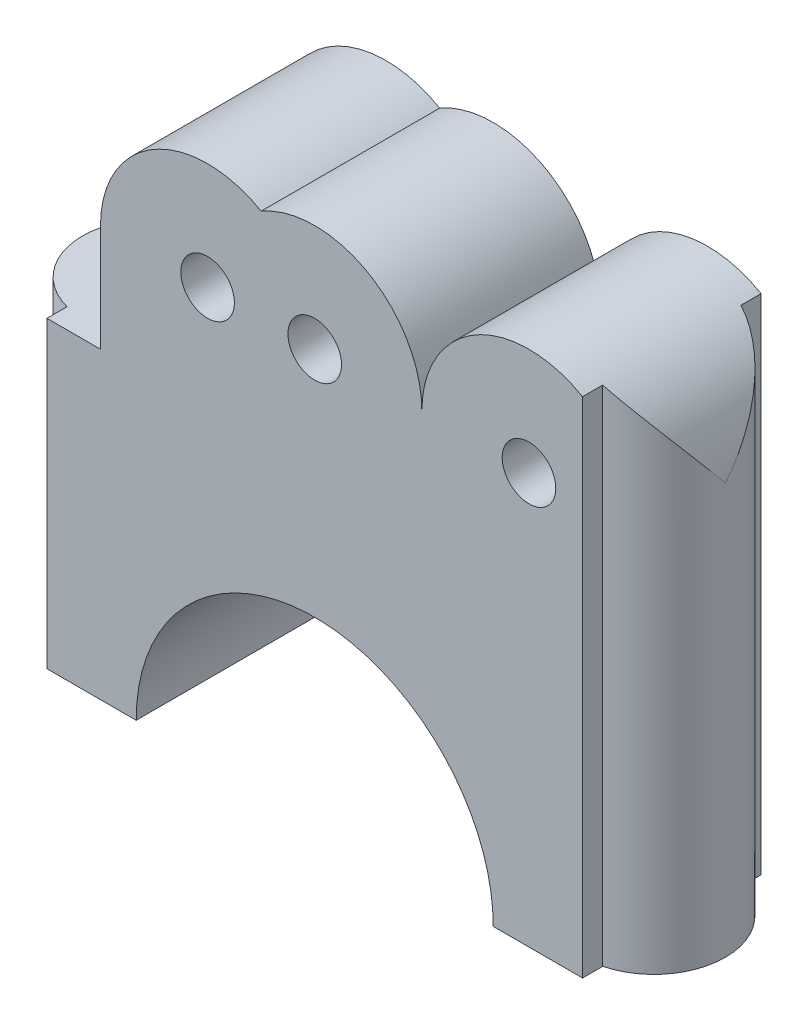
ISO-10303-21;
HEADER;
FILE_DESCRIPTION(('STEP AP214'),'2;1');
FILE_NAME('part.step','',(''),(''),'','','');
FILE_SCHEMA(('AUTOMOTIVE_DESIGN { 1 0 10303 214 1 1 1 1 }'));
ENDSEC;
DATA;
#1=APPLICATION_CONTEXT('core data for automotive mechanical design processes');
#2=APPLICATION_PROTOCOL_DEFINITION('international standard','automotive_design',2000,#1);
#3=PRODUCT_CONTEXT('',#1,'mechanical');
#4=PRODUCT('Part','Part','',(#3));
#5=PRODUCT_RELATED_PRODUCT_CATEGORY('part','',(#4));
#6=PRODUCT_DEFINITION_FORMATION('','',#4);
#7=PRODUCT_DEFINITION_CONTEXT('part definition',#1,'design');
#8=PRODUCT_DEFINITION('design','',#6,#7);
#9=PRODUCT_DEFINITION_SHAPE('','',#8);
#10=(LENGTH_UNIT() NAMED_UNIT(*) SI_UNIT(.MILLI.,.METRE.));
#11=(NAMED_UNIT(*) PLANE_ANGLE_UNIT() SI_UNIT($,.RADIAN.));
#12=(NAMED_UNIT(*) SI_UNIT($,.STERADIAN.) SOLID_ANGLE_UNIT());
#13=UNCERTAINTY_MEASURE_WITH_UNIT(LENGTH_MEASURE(1.E-05),#10,'distance_accuracy_value','');
#14=(GEOMETRIC_REPRESENTATION_CONTEXT(3) GLOBAL_UNCERTAINTY_ASSIGNED_CONTEXT((#13)) GLOBAL_UNIT_ASSIGNED_CONTEXT((#10,
#11,#12)) REPRESENTATION_CONTEXT('',''));
#15=CARTESIAN_POINT('',(0.,0.,0.));
#16=DIRECTION('',(0.,0.,1.));
#17=DIRECTION('',(1.,0.,0.));
#18=AXIS2_PLACEMENT_3D('',#15,#16,#17);
#19=CARTESIAN_POINT('',(0.,0.,0.));
#20=DIRECTION('',(0.,1.,0.));
#21=DIRECTION('',(0.,0.,1.));
#22=AXIS2_PLACEMENT_3D('',#19,#20,#21);
#23=PLANE('',#22);
#24=DIRECTION('',(0.,0.,-1.));
#25=VECTOR('',#24,1.);
#26=CARTESIAN_POINT('',(-10.,0.,10.));
#27=LINE('',#26,#25);
#28=CARTESIAN_POINT('',(-10.,0.,0.));
#29=VERTEX_POINT('',#28);
#30=CARTESIAN_POINT('',(-10.,0.,10.));
#31=VERTEX_POINT('',#30);
#32=EDGE_CURVE('E273',#29,#31,#27,.F.);
#33=ORIENTED_EDGE('',*,*,#32,.T.);
#34=DIRECTION('',(-1.,0.,0.));
#35=VECTOR('',#34,1.);
#36=CARTESIAN_POINT('',(0.,0.,10.));
#37=LINE('',#36,#35);
#38=CARTESIAN_POINT('',(-15.,0.,10.));
#39=VERTEX_POINT('',#38);
#40=EDGE_CURVE('E288',#31,#39,#37,.T.);
#41=ORIENTED_EDGE('',*,*,#40,.T.);
#42=DIRECTION('',(0.,0.,-1.));
#43=VECTOR('',#42,1.);
#44=CARTESIAN_POINT('',(-15.,0.,0.));
#45=LINE('',#44,#43);
#46=CARTESIAN_POINT('',(-15.,0.,8.87298334620742));
#47=VERTEX_POINT('',#46);
#48=EDGE_CURVE('E11',#39,#47,#45,.T.);
#49=ORIENTED_EDGE('',*,*,#48,.T.);
#50=CARTESIAN_POINT('',(-14.,0.,5.));
#51=DIRECTION('',(0.,1.,0.));
#52=DIRECTION('',(0.,0.,1.));
#53=AXIS2_PLACEMENT_3D('',#50,#51,#52);
#54=CIRCLE('',#53,4.);
#55=CARTESIAN_POINT('',(-15.,0.,1.12701665379258));
#56=VERTEX_POINT('',#55);
#57=EDGE_CURVE('E51',#47,#56,#54,.F.);
#58=ORIENTED_EDGE('',*,*,#57,.T.);
#59=DIRECTION('',(0.,0.,-1.));
#60=VECTOR('',#59,1.);
#61=CARTESIAN_POINT('',(-15.,0.,0.));
#62=LINE('',#61,#60);
#63=CARTESIAN_POINT('',(-15.,0.,0.));
#64=VERTEX_POINT('',#63);
#65=EDGE_CURVE('E289',#56,#64,#62,.T.);
#66=ORIENTED_EDGE('',*,*,#65,.T.);
#67=DIRECTION('',(-1.,0.,0.));
#68=VECTOR('',#67,1.);
#69=CARTESIAN_POINT('',(0.,0.,0.));
#70=LINE('',#69,#68);
#71=EDGE_CURVE('E282',#29,#64,#70,.T.);
#72=ORIENTED_EDGE('',*,*,#71,.F.);
#73=EDGE_LOOP('',(#33,#41,#49,#58,#66,#72));
#74=FACE_BOUND('',#73,.T.);
#75=CARTESIAN_POINT('',(-14.,0.,5.));
#76=DIRECTION('',(0.,1.,0.));
#77=DIRECTION('',(0.,0.,1.));
#78=AXIS2_PLACEMENT_3D('',#75,#76,#77);
#79=CIRCLE('',#78,2.);
#80=CARTESIAN_POINT('',(-14.,0.,7.));
#81=VERTEX_POINT('',#80);
#82=EDGE_CURVE('E38',#81,#81,#79,.F.);
#83=ORIENTED_EDGE('',*,*,#82,.F.);
#84=EDGE_LOOP('',(#83));
#85=FACE_BOUND('',#84,.T.);
#86=ADVANCED_FACE('F34',(#74,#85),#23,.F.);
#87=CARTESIAN_POINT('',(-6.00000000000001,23.,10.));
#88=DIRECTION('',(0.,0.,-1.));
#89=DIRECTION('',(-1.,0.,0.));
#90=AXIS2_PLACEMENT_3D('',#87,#88,#89);
#91=CYLINDRICAL_SURFACE('',#90,1.5);
#92=CARTESIAN_POINT('',(-6.00000000000001,23.,10.));
#93=DIRECTION('',(0.,0.,1.));
#94=DIRECTION('',(1.,0.,0.));
#95=AXIS2_PLACEMENT_3D('',#92,#93,#94);
#96=CIRCLE('',#95,1.5);
#97=CARTESIAN_POINT('',(-4.50000000000001,23.,10.));
#98=VERTEX_POINT('',#97);
#99=EDGE_CURVE('E258',#98,#98,#96,.T.);
#100=ORIENTED_EDGE('',*,*,#99,.T.);
#101=EDGE_LOOP('',(#100));
#102=FACE_BOUND('',#101,.T.);
#103=CARTESIAN_POINT('',(-6.00000000000001,23.,0.));
#104=DIRECTION('',(0.,0.,1.));
#105=DIRECTION('',(1.,0.,0.));
#106=AXIS2_PLACEMENT_3D('',#103,#104,#105);
#107=CIRCLE('',#106,1.5);
#108=CARTESIAN_POINT('',(-4.50000000000001,23.,0.));
#109=VERTEX_POINT('',#108);
#110=EDGE_CURVE('E304',#109,#109,#107,.T.);
#111=ORIENTED_EDGE('',*,*,#110,.F.);
#112=EDGE_LOOP('',(#111));
#113=FACE_BOUND('',#112,.T.);
#114=ADVANCED_FACE('F36',(#102,#113),#91,.F.);
#115=CARTESIAN_POINT('',(0.,23.,10.));
#116=DIRECTION('',(0.,0.,-1.));
#117=DIRECTION('',(-1.,0.,0.));
#118=AXIS2_PLACEMENT_3D('',#115,#116,#117);
#119=CYLINDRICAL_SURFACE('',#118,1.5);
#120=CARTESIAN_POINT('',(0.,23.,10.));
#121=DIRECTION('',(0.,0.,1.));
#122=DIRECTION('',(1.,0.,0.));
#123=AXIS2_PLACEMENT_3D('',#120,#121,#122);
#124=CIRCLE('',#123,1.5);
#125=CARTESIAN_POINT('',(1.5,23.,10.));
#126=VERTEX_POINT('',#125);
#127=EDGE_CURVE('E241',#126,#126,#124,.T.);
#128=ORIENTED_EDGE('',*,*,#127,.T.);
#129=EDGE_LOOP('',(#128));
#130=FACE_BOUND('',#129,.T.);
#131=CARTESIAN_POINT('',(0.,23.,0.));
#132=DIRECTION('',(0.,0.,1.));
#133=DIRECTION('',(1.,0.,0.));
#134=AXIS2_PLACEMENT_3D('',#131,#132,#133);
#135=CIRCLE('',#134,1.5);
#136=CARTESIAN_POINT('',(1.5,23.,0.));
#137=VERTEX_POINT('',#136);
#138=EDGE_CURVE('E244',#137,#137,#135,.T.);
#139=ORIENTED_EDGE('',*,*,#138,.F.);
#140=EDGE_LOOP('',(#139));
#141=FACE_BOUND('',#140,.T.);
#142=ADVANCED_FACE('F229',(#130,#141),#119,.F.);
#143=CARTESIAN_POINT('',(12.,23.,10.));
#144=DIRECTION('',(0.,0.,-1.));
#145=DIRECTION('',(-1.,0.,0.));
#146=AXIS2_PLACEMENT_3D('',#143,#144,#145);
#147=CYLINDRICAL_SURFACE('',#146,1.5);
#148=CARTESIAN_POINT('',(12.,23.,10.));
#149=DIRECTION('',(0.,0.,1.));
#150=DIRECTION('',(1.,0.,0.));
#151=AXIS2_PLACEMENT_3D('',#148,#149,#150);
#152=CIRCLE('',#151,1.5);
#153=CARTESIAN_POINT('',(13.5,23.,10.));
#154=VERTEX_POINT('',#153);
#155=EDGE_CURVE('E325',#154,#154,#152,.T.);
#156=ORIENTED_EDGE('',*,*,#155,.T.);
#157=EDGE_LOOP('',(#156));
#158=FACE_BOUND('',#157,.T.);
#159=CARTESIAN_POINT('',(12.,23.,0.));
#160=DIRECTION('',(0.,0.,1.));
#161=DIRECTION('',(1.,0.,0.));
#162=AXIS2_PLACEMENT_3D('',#159,#160,#161);
#163=CIRCLE('',#162,1.5);
#164=CARTESIAN_POINT('',(13.5,23.,0.));
#165=VERTEX_POINT('',#164);
#166=EDGE_CURVE('E246',#165,#165,#163,.T.);
#167=ORIENTED_EDGE('',*,*,#166,.F.);
#168=EDGE_LOOP('',(#167));
#169=FACE_BOUND('',#168,.T.);
#170=ADVANCED_FACE('F226',(#158,#169),#147,.F.);
#171=CARTESIAN_POINT('',(0.,23.,10.));
#172=DIRECTION('',(0.,0.,-1.));
#173=DIRECTION('',(-1.,0.,0.));
#174=AXIS2_PLACEMENT_3D('',#171,#172,#173);
#175=CYLINDRICAL_SURFACE('',#174,6.);
#176=CARTESIAN_POINT('',(0.,23.,0.));
#177=DIRECTION('',(0.,0.,1.));
#178=DIRECTION('',(1.,0.,0.));
#179=AXIS2_PLACEMENT_3D('',#176,#177,#178);
#180=CIRCLE('',#179,6.);
#181=CARTESIAN_POINT('',(6.,23.,0.));
#182=VERTEX_POINT('',#181);
#183=CARTESIAN_POINT('',(-3.00000000000001,28.1961524227066,0.));
#184=VERTEX_POINT('',#183);
#185=EDGE_CURVE('E332',#182,#184,#180,.T.);
#186=ORIENTED_EDGE('',*,*,#185,.T.);
#187=DIRECTION('',(0.,0.,-1.));
#188=VECTOR('',#187,1.);
#189=CARTESIAN_POINT('',(-3.00000000000001,28.1961524227066,10.));
#190=LINE('',#189,#188);
#191=CARTESIAN_POINT('',(-3.00000000000001,28.1961524227066,10.));
#192=VERTEX_POINT('',#191);
#193=EDGE_CURVE('E270',#192,#184,#190,.T.);
#194=ORIENTED_EDGE('',*,*,#193,.F.);
#195=CARTESIAN_POINT('',(0.,23.,10.));
#196=DIRECTION('',(0.,0.,1.));
#197=DIRECTION('',(1.,0.,0.));
#198=AXIS2_PLACEMENT_3D('',#195,#196,#197);
#199=CIRCLE('',#198,6.);
#200=CARTESIAN_POINT('',(6.,23.,10.));
#201=VERTEX_POINT('',#200);
#202=EDGE_CURVE('E312',#201,#192,#199,.T.);
#203=ORIENTED_EDGE('',*,*,#202,.F.);
#204=DIRECTION('',(0.,0.,-1.));
#205=VECTOR('',#204,1.);
#206=CARTESIAN_POINT('',(6.,23.,10.));
#207=LINE('',#206,#205);
#208=EDGE_CURVE('E259',#201,#182,#207,.T.);
#209=ORIENTED_EDGE('',*,*,#208,.T.);
#210=EDGE_LOOP('',(#186,#194,#203,#209));
#211=FACE_BOUND('',#210,.T.);
#212=ADVANCED_FACE('F228',(#211),#175,.T.);
#213=CARTESIAN_POINT('',(-6.00000000000001,23.,10.));
#214=DIRECTION('',(0.,0.,-1.));
#215=DIRECTION('',(-1.,0.,0.));
#216=AXIS2_PLACEMENT_3D('',#213,#214,#215);
#217=CYLINDRICAL_SURFACE('',#216,6.);
#218=CARTESIAN_POINT('',(-6.00000000000001,23.,0.));
#219=DIRECTION('',(0.,0.,1.));
#220=DIRECTION('',(1.,0.,0.));
#221=AXIS2_PLACEMENT_3D('',#218,#219,#220);
#222=CIRCLE('',#221,6.);
#223=CARTESIAN_POINT('',(-12.,23.,0.));
#224=VERTEX_POINT('',#223);
#225=EDGE_CURVE('E335',#184,#224,#222,.T.);
#226=ORIENTED_EDGE('',*,*,#225,.T.);
#227=DIRECTION('',(0.,0.,-1.));
#228=VECTOR('',#227,1.);
#229=CARTESIAN_POINT('',(-12.,23.,10.));
#230=LINE('',#229,#228);
#231=CARTESIAN_POINT('',(-12.,23.,10.));
#232=VERTEX_POINT('',#231);
#233=EDGE_CURVE('E267',#232,#224,#230,.T.);
#234=ORIENTED_EDGE('',*,*,#233,.F.);
#235=CARTESIAN_POINT('',(-6.00000000000001,23.,10.));
#236=DIRECTION('',(0.,0.,1.));
#237=DIRECTION('',(1.,0.,0.));
#238=AXIS2_PLACEMENT_3D('',#235,#236,#237);
#239=CIRCLE('',#238,6.);
#240=EDGE_CURVE('E315',#192,#232,#239,.T.);
#241=ORIENTED_EDGE('',*,*,#240,.F.);
#242=ORIENTED_EDGE('',*,*,#193,.T.);
#243=EDGE_LOOP('',(#226,#234,#241,#242));
#244=FACE_BOUND('',#243,.T.);
#245=ADVANCED_FACE('F355',(#244),#217,.T.);
#246=CARTESIAN_POINT('',(-12.,0.,10.));
#247=DIRECTION('',(1.,0.,0.));
#248=DIRECTION('',(0.,0.,-1.));
#249=AXIS2_PLACEMENT_3D('',#246,#247,#248);
#250=PLANE('',#249);
#251=DIRECTION('',(0.,-1.,0.));
#252=VECTOR('',#251,1.);
#253=CARTESIAN_POINT('',(-12.,0.,0.));
#254=LINE('',#253,#252);
#255=CARTESIAN_POINT('',(-12.,17.,0.));
#256=VERTEX_POINT('',#255);
#257=EDGE_CURVE('E337',#224,#256,#254,.T.);
#258=ORIENTED_EDGE('',*,*,#257,.T.);
#259=DIRECTION('',(0.,0.,-1.));
#260=VECTOR('',#259,1.);
#261=CARTESIAN_POINT('',(-12.,17.,10.));
#262=LINE('',#261,#260);
#263=CARTESIAN_POINT('',(-12.,17.,5.));
#264=VERTEX_POINT('',#263);
#265=EDGE_CURVE('E262',#264,#256,#262,.T.);
#266=ORIENTED_EDGE('',*,*,#265,.F.);
#267=CARTESIAN_POINT('',(-12.,17.,10.));
#268=VERTEX_POINT('',#267);
#269=EDGE_CURVE('E264',#268,#264,#262,.T.);
#270=ORIENTED_EDGE('',*,*,#269,.F.);
#271=DIRECTION('',(0.,-1.,0.));
#272=VECTOR('',#271,1.);
#273=CARTESIAN_POINT('',(-12.,0.,10.));
#274=LINE('',#273,#272);
#275=EDGE_CURVE('E317',#232,#268,#274,.T.);
#276=ORIENTED_EDGE('',*,*,#275,.F.);
#277=ORIENTED_EDGE('',*,*,#233,.T.);
#278=EDGE_LOOP('',(#258,#266,#270,#276,#277));
#279=FACE_BOUND('',#278,.T.);
#280=ADVANCED_FACE('F195',(#279),#250,.F.);
#281=CARTESIAN_POINT('',(-15.,22.8309518948453,0.));
#282=DIRECTION('',(-1.,0.,0.));
#283=DIRECTION('',(0.,0.,1.));
#284=AXIS2_PLACEMENT_3D('',#281,#282,#283);
#285=PLANE('',#284);
#286=ORIENTED_EDGE('',*,*,#65,.F.);
#287=DIRECTION('',(0.,-1.,0.));
#288=VECTOR('',#287,1.);
#289=CARTESIAN_POINT('',(-15.,22.8309518948453,1.12701665379258));
#290=LINE('',#289,#288);
#291=CARTESIAN_POINT('',(-15.,17.,1.12701665379258));
#292=VERTEX_POINT('',#291);
#293=EDGE_CURVE('E378',#292,#56,#290,.T.);
#294=ORIENTED_EDGE('',*,*,#293,.F.);
#295=DIRECTION('',(0.,0.,-1.));
#296=VECTOR('',#295,1.);
#297=CARTESIAN_POINT('',(-15.,17.,0.));
#298=LINE('',#297,#296);
#299=CARTESIAN_POINT('',(-15.,17.,0.));
#300=VERTEX_POINT('',#299);
#301=EDGE_CURVE('E366',#292,#300,#298,.T.);
#302=ORIENTED_EDGE('',*,*,#301,.T.);
#303=DIRECTION('',(0.,-1.,0.));
#304=VECTOR('',#303,1.);
#305=CARTESIAN_POINT('',(-15.,22.8309518948453,0.));
#306=LINE('',#305,#304);
#307=EDGE_CURVE('E346',#300,#64,#306,.T.);
#308=ORIENTED_EDGE('',*,*,#307,.T.);
#309=EDGE_LOOP('',(#286,#294,#302,#308));
#310=FACE_BOUND('',#309,.T.);
#311=ADVANCED_FACE('F192',(#310),#285,.T.);
#312=CARTESIAN_POINT('',(12.,23.,10.));
#313=DIRECTION('',(0.,0.,-1.));
#314=DIRECTION('',(-1.,0.,0.));
#315=AXIS2_PLACEMENT_3D('',#312,#313,#314);
#316=CYLINDRICAL_SURFACE('',#315,6.);
#317=CARTESIAN_POINT('',(15.,28.1961524227066,1.12701665379259));
#318=CARTESIAN_POINT('',(15.1463982107363,28.1116595589644,1.16483133114622));
#319=CARTESIAN_POINT('',(15.2875427708672,28.0218954935515,1.21010783591986));
#320=CARTESIAN_POINT('',(15.5584449932693,27.833684259771,1.31323825160009));
#321=CARTESIAN_POINT('',(15.6882330785889,27.7352618014728,1.37105701883585));
#322=CARTESIAN_POINT('',(15.934763123759,27.5324203274726,1.49634867818663));
#323=CARTESIAN_POINT('',(16.0516513715442,27.4280946861744,1.56368788023842));
#324=CARTESIAN_POINT('',(16.2743848112428,27.2134978459991,1.70686853516862));
#325=CARTESIAN_POINT('',(16.3802209058418,27.1032218607202,1.7827168872834));
#326=CARTESIAN_POINT('',(16.5988804861554,26.8577119727124,1.95556819664727));
#327=CARTESIAN_POINT('',(16.7095727157402,26.7215396870201,2.05392933204321));
#328=CARTESIAN_POINT('',(16.9162107702691,26.4439534768,2.2583153841049));
#329=CARTESIAN_POINT('',(17.0121568658285,26.3025396485221,2.36434016007793));
#330=CARTESIAN_POINT('',(17.1903748788665,26.0147657015954,2.58307628637922));
#331=CARTESIAN_POINT('',(17.2725660432999,25.868382053022,2.69582219147766));
#332=CARTESIAN_POINT('',(17.4231605851167,25.5723377426357,2.92613658899492));
#333=CARTESIAN_POINT('',(17.4915605552477,25.4226762811064,3.04370626456107));
#334=CARTESIAN_POINT('',(17.6285482314045,25.0878059641933,3.30870352823977));
#335=CARTESIAN_POINT('',(17.6939037964622,24.9019828149879,3.4570365239424));
#336=CARTESIAN_POINT('',(17.8055177898272,24.527784407956,3.7575234955895));
#337=CARTESIAN_POINT('',(17.8517702626138,24.3394083731249,3.90967864745822));
#338=CARTESIAN_POINT('',(17.9623907019057,23.7729765292327,4.36887270512215));
#339=CARTESIAN_POINT('',(17.9992282599215,23.3920964362314,4.67985465535394));
#340=CARTESIAN_POINT('',(17.9999959953983,23.007999912235,4.99346810090406));
#341=CARTESIAN_POINT('',(17.9999999951192,23.0039999100644,4.99673408903371));
#342=CARTESIAN_POINT('',(18.,23.,5.00000000000001));
#343=B_SPLINE_CURVE_WITH_KNOTS('',3,(#317,#318,#319,#320,#321,#322,#323,#324,#325,#326,#327,
#328,#329,#330,#331,#332,#333,#334,#335,#336,#337,#338,#339,#340,#341,#342),.UNSPECIFIED.,.F.,
.F.,(4,2,2,2,2,2,2,2,2,2,2,2,4),(0.,0.518963022409765,1.03649026273815,1.54736321887512,
2.05865342707105,2.66131394575527,3.26396340332214,3.87003543069455,4.47625701123374,
5.21509288027066,5.95415891293033,7.42623377759536,7.44172571562784),.UNSPECIFIED.);
#344=CARTESIAN_POINT('',(18.,23.,5.00000000000001));
#345=VERTEX_POINT('',#344);
#346=CARTESIAN_POINT('',(15.,28.1961524227066,1.12701665379259));
#347=VERTEX_POINT('',#346);
#348=EDGE_CURVE('E143',#345,#347,#343,.F.);
#349=ORIENTED_EDGE('',*,*,#348,.T.);
#350=DIRECTION('',(0.,0.,-1.));
#351=VECTOR('',#350,1.);
#352=CARTESIAN_POINT('',(15.,28.1961524227066,10.));
#353=LINE('',#352,#351);
#354=CARTESIAN_POINT('',(15.,28.1961524227066,0.));
#355=VERTEX_POINT('',#354);
#356=EDGE_CURVE('E154',#347,#355,#353,.T.);
#357=ORIENTED_EDGE('',*,*,#356,.T.);
#358=CARTESIAN_POINT('',(12.,23.,0.));
#359=DIRECTION('',(0.,0.,1.));
#360=DIRECTION('',(1.,0.,0.));
#361=AXIS2_PLACEMENT_3D('',#358,#359,#360);
#362=CIRCLE('',#361,6.);
#363=EDGE_CURVE('E247',#355,#182,#362,.T.);
#364=ORIENTED_EDGE('',*,*,#363,.T.);
#365=ORIENTED_EDGE('',*,*,#208,.F.);
#366=CARTESIAN_POINT('',(12.,23.,10.));
#367=DIRECTION('',(0.,0.,1.));
#368=DIRECTION('',(1.,0.,0.));
#369=AXIS2_PLACEMENT_3D('',#366,#367,#368);
#370=CIRCLE('',#369,6.);
#371=CARTESIAN_POINT('',(15.,28.1961524227066,10.));
#372=VERTEX_POINT('',#371);
#373=EDGE_CURVE('E322',#372,#201,#370,.T.);
#374=ORIENTED_EDGE('',*,*,#373,.F.);
#375=DIRECTION('',(0.,0.,-1.));
#376=VECTOR('',#375,1.);
#377=CARTESIAN_POINT('',(15.,28.1961524227066,10.));
#378=LINE('',#377,#376);
#379=CARTESIAN_POINT('',(15.,28.1961524227066,8.87298334620743));
#380=VERTEX_POINT('',#379);
#381=EDGE_CURVE('E159',#372,#380,#378,.T.);
#382=ORIENTED_EDGE('',*,*,#381,.T.);
#383=CARTESIAN_POINT('',(15.,28.1961524227066,8.87298334620743));
#384=CARTESIAN_POINT('',(15.1463982107363,28.1116595589644,8.8351686688538));
#385=CARTESIAN_POINT('',(15.2875427708672,28.0218954935515,8.78989216408016));
#386=CARTESIAN_POINT('',(15.5584449932693,27.833684259771,8.68676174839993));
#387=CARTESIAN_POINT('',(15.6882330785889,27.7352618014728,8.62894298116417));
#388=CARTESIAN_POINT('',(15.934763123759,27.5324203274726,8.5036513218134));
#389=CARTESIAN_POINT('',(16.0516513715442,27.4280946861744,8.4363121197616));
#390=CARTESIAN_POINT('',(16.2743848112428,27.2134978459991,8.2931314648314));
#391=CARTESIAN_POINT('',(16.3802209058418,27.1032218607202,8.21728311271662));
#392=CARTESIAN_POINT('',(16.5988804861554,26.8577119727124,8.04443180335275));
#393=CARTESIAN_POINT('',(16.7095727157402,26.7215396870201,7.94607066795682));
#394=CARTESIAN_POINT('',(16.9162107702691,26.4439534768,7.74168461589512));
#395=CARTESIAN_POINT('',(17.0121568658285,26.3025396485221,7.6356598399221));
#396=CARTESIAN_POINT('',(17.1903748788665,26.0147657015954,7.41692371362081));
#397=CARTESIAN_POINT('',(17.2725660432999,25.868382053022,7.30417780852237));
#398=CARTESIAN_POINT('',(17.4231605851167,25.5723377426357,7.0738634110051));
#399=CARTESIAN_POINT('',(17.4915605552477,25.4226762811064,6.95629373543896));
#400=CARTESIAN_POINT('',(17.6285482314045,25.0878059641933,6.69129647176026));
#401=CARTESIAN_POINT('',(17.6939037964622,24.9019828149879,6.54296347605764));
#402=CARTESIAN_POINT('',(17.8055177898272,24.527784407956,6.24247650441051));
#403=CARTESIAN_POINT('',(17.8517702626138,24.339408373125,6.09032135254174));
#404=CARTESIAN_POINT('',(17.9623907019057,23.7729765292326,5.63112729487798));
#405=CARTESIAN_POINT('',(17.9992282599215,23.3920964362308,5.32014534464671));
#406=CARTESIAN_POINT('',(17.9999959953983,23.007999912235,5.00653189909598));
#407=CARTESIAN_POINT('',(17.9999999951192,23.0039999100644,5.00326591096631));
#408=CARTESIAN_POINT('',(18.,23.,5.00000000000001));
#409=B_SPLINE_CURVE_WITH_KNOTS('',3,(#383,#384,#385,#386,#387,#388,#389,#390,#391,#392,#393,
#394,#395,#396,#397,#398,#399,#400,#401,#402,#403,#404,#405,#406,#407,#408),.UNSPECIFIED.,.F.,
.F.,(4,2,2,2,2,2,2,2,2,2,2,2,4),(0.,0.51896302240977,1.03649026273815,1.54736321887513,
2.05865342707105,2.66131394575527,3.26396340332213,3.87003543069454,4.47625701123373,
5.21509288027067,5.95415891293034,7.42623377759537,7.44172571562785),.UNSPECIFIED.);
#410=EDGE_CURVE('E147',#380,#345,#409,.T.);
#411=ORIENTED_EDGE('',*,*,#410,.T.);
#412=EDGE_LOOP('',(#349,#357,#364,#365,#374,#382,#411));
#413=FACE_BOUND('',#412,.T.);
#414=ADVANCED_FACE('F156',(#413),#316,.T.);
#415=CARTESIAN_POINT('',(-14.,22.8309518948453,5.));
#416=DIRECTION('',(0.,-1.,0.));
#417=DIRECTION('',(0.,0.,-1.));
#418=AXIS2_PLACEMENT_3D('',#415,#416,#417);
#419=CYLINDRICAL_SURFACE('',#418,4.);
#420=ORIENTED_EDGE('',*,*,#57,.F.);
#421=DIRECTION('',(0.,-1.,0.));
#422=VECTOR('',#421,1.);
#423=CARTESIAN_POINT('',(-15.,22.8309518948453,8.87298334620742));
#424=LINE('',#423,#422);
#425=CARTESIAN_POINT('',(-15.,17.,8.87298334620742));
#426=VERTEX_POINT('',#425);
#427=EDGE_CURVE('E161',#426,#47,#424,.T.);
#428=ORIENTED_EDGE('',*,*,#427,.F.);
#429=CARTESIAN_POINT('',(-14.,17.,5.));
#430=DIRECTION('',(0.,1.,0.));
#431=DIRECTION('',(0.,0.,1.));
#432=AXIS2_PLACEMENT_3D('',#429,#430,#431);
#433=CIRCLE('',#432,4.);
#434=EDGE_CURVE('E365',#426,#292,#433,.F.);
#435=ORIENTED_EDGE('',*,*,#434,.T.);
#436=ORIENTED_EDGE('',*,*,#293,.T.);
#437=EDGE_LOOP('',(#420,#428,#435,#436));
#438=FACE_BOUND('',#437,.T.);
#439=ADVANCED_FACE('F188',(#438),#419,.T.);
#440=CARTESIAN_POINT('',(0.,17.,10.));
#441=DIRECTION('',(0.,1.,0.));
#442=DIRECTION('',(0.,0.,1.));
#443=AXIS2_PLACEMENT_3D('',#440,#441,#442);
#444=PLANE('',#443);
#445=ORIENTED_EDGE('',*,*,#434,.F.);
#446=DIRECTION('',(0.,0.,-1.));
#447=VECTOR('',#446,1.);
#448=CARTESIAN_POINT('',(-15.,17.,0.));
#449=LINE('',#448,#447);
#450=CARTESIAN_POINT('',(-15.,17.,10.));
#451=VERTEX_POINT('',#450);
#452=EDGE_CURVE('E368',#451,#426,#449,.T.);
#453=ORIENTED_EDGE('',*,*,#452,.F.);
#454=DIRECTION('',(1.,0.,0.));
#455=VECTOR('',#454,1.);
#456=CARTESIAN_POINT('',(0.,17.,10.));
#457=LINE('',#456,#455);
#458=EDGE_CURVE('E320',#451,#268,#457,.T.);
#459=ORIENTED_EDGE('',*,*,#458,.T.);
#460=ORIENTED_EDGE('',*,*,#269,.T.);
#461=CARTESIAN_POINT('',(-14.,17.,5.));
#462=DIRECTION('',(0.,1.,0.));
#463=DIRECTION('',(0.,0.,1.));
#464=AXIS2_PLACEMENT_3D('',#461,#462,#463);
#465=CIRCLE('',#464,2.);
#466=EDGE_CURVE('E300',#264,#264,#465,.F.);
#467=ORIENTED_EDGE('',*,*,#466,.T.);
#468=ORIENTED_EDGE('',*,*,#265,.T.);
#469=DIRECTION('',(1.,0.,0.));
#470=VECTOR('',#469,1.);
#471=CARTESIAN_POINT('',(0.,17.,0.));
#472=LINE('',#471,#470);
#473=EDGE_CURVE('E252',#300,#256,#472,.T.);
#474=ORIENTED_EDGE('',*,*,#473,.F.);
#475=ORIENTED_EDGE('',*,*,#301,.F.);
#476=EDGE_LOOP('',(#445,#453,#459,#460,#467,#468,#474,#475));
#477=FACE_BOUND('',#476,.T.);
#478=ADVANCED_FACE('F191',(#477),#444,.T.);
#479=CARTESIAN_POINT('',(0.,0.,0.));
#480=DIRECTION('',(0.,0.,1.));
#481=DIRECTION('',(1.,0.,0.));
#482=AXIS2_PLACEMENT_3D('',#479,#480,#481);
#483=PLANE('',#482);
#484=DIRECTION('',(0.,-1.,0.));
#485=VECTOR('',#484,1.);
#486=CARTESIAN_POINT('',(15.,22.8309518948453,0.));
#487=LINE('',#486,#485);
#488=CARTESIAN_POINT('',(15.,0.,0.));
#489=VERTEX_POINT('',#488);
#490=EDGE_CURVE('E362',#355,#489,#487,.T.);
#491=ORIENTED_EDGE('',*,*,#490,.T.);
#492=CARTESIAN_POINT('',(10.,0.,0.));
#493=VERTEX_POINT('',#492);
#494=EDGE_CURVE('E278',#489,#493,#70,.T.);
#495=ORIENTED_EDGE('',*,*,#494,.T.);
#496=CARTESIAN_POINT('',(0.,0.,0.));
#497=DIRECTION('',(0.,0.,1.));
#498=DIRECTION('',(1.,0.,0.));
#499=AXIS2_PLACEMENT_3D('',#496,#497,#498);
#500=CIRCLE('',#499,10.);
#501=EDGE_CURVE('E250',#493,#29,#500,.T.);
#502=ORIENTED_EDGE('',*,*,#501,.T.);
#503=ORIENTED_EDGE('',*,*,#71,.T.);
#504=ORIENTED_EDGE('',*,*,#307,.F.);
#505=ORIENTED_EDGE('',*,*,#473,.T.);
#506=ORIENTED_EDGE('',*,*,#257,.F.);
#507=ORIENTED_EDGE('',*,*,#225,.F.);
#508=ORIENTED_EDGE('',*,*,#185,.F.);
#509=ORIENTED_EDGE('',*,*,#363,.F.);
#510=EDGE_LOOP('',(#491,#495,#502,#503,#504,#505,#506,#507,#508,#509));
#511=FACE_BOUND('',#510,.T.);
#512=ORIENTED_EDGE('',*,*,#166,.T.);
#513=EDGE_LOOP('',(#512));
#514=FACE_BOUND('',#513,.T.);
#515=ORIENTED_EDGE('',*,*,#138,.T.);
#516=EDGE_LOOP('',(#515));
#517=FACE_BOUND('',#516,.T.);
#518=ORIENTED_EDGE('',*,*,#110,.T.);
#519=EDGE_LOOP('',(#518));
#520=FACE_BOUND('',#519,.T.);
#521=ADVANCED_FACE('F218',(#511,#514,#517,#520),#483,.F.);
#522=CARTESIAN_POINT('',(0.,0.,10.));
#523=DIRECTION('',(0.,0.,1.));
#524=DIRECTION('',(1.,0.,0.));
#525=AXIS2_PLACEMENT_3D('',#522,#523,#524);
#526=PLANE('',#525);
#527=CARTESIAN_POINT('',(15.,0.,10.));
#528=VERTEX_POINT('',#527);
#529=CARTESIAN_POINT('',(10.,0.,10.));
#530=VERTEX_POINT('',#529);
#531=EDGE_CURVE('E281',#528,#530,#37,.T.);
#532=ORIENTED_EDGE('',*,*,#531,.F.);
#533=DIRECTION('',(0.,-1.,0.));
#534=VECTOR('',#533,1.);
#535=CARTESIAN_POINT('',(15.,22.8309518948453,10.));
#536=LINE('',#535,#534);
#537=EDGE_CURVE('E306',#372,#528,#536,.T.);
#538=ORIENTED_EDGE('',*,*,#537,.F.);
#539=ORIENTED_EDGE('',*,*,#373,.T.);
#540=ORIENTED_EDGE('',*,*,#202,.T.);
#541=ORIENTED_EDGE('',*,*,#240,.T.);
#542=ORIENTED_EDGE('',*,*,#275,.T.);
#543=ORIENTED_EDGE('',*,*,#458,.F.);
#544=DIRECTION('',(0.,-1.,0.));
#545=VECTOR('',#544,1.);
#546=CARTESIAN_POINT('',(-15.,22.8309518948453,10.));
#547=LINE('',#546,#545);
#548=EDGE_CURVE('E373',#451,#39,#547,.T.);
#549=ORIENTED_EDGE('',*,*,#548,.T.);
#550=ORIENTED_EDGE('',*,*,#40,.F.);
#551=CARTESIAN_POINT('',(0.,0.,10.));
#552=DIRECTION('',(0.,0.,1.));
#553=DIRECTION('',(1.,0.,0.));
#554=AXIS2_PLACEMENT_3D('',#551,#552,#553);
#555=CIRCLE('',#554,10.);
#556=EDGE_CURVE('E263',#530,#31,#555,.T.);
#557=ORIENTED_EDGE('',*,*,#556,.F.);
#558=EDGE_LOOP('',(#532,#538,#539,#540,#541,#542,#543,#549,#550,#557));
#559=FACE_BOUND('',#558,.T.);
#560=ORIENTED_EDGE('',*,*,#99,.F.);
#561=EDGE_LOOP('',(#560));
#562=FACE_BOUND('',#561,.T.);
#563=ORIENTED_EDGE('',*,*,#127,.F.);
#564=EDGE_LOOP('',(#563));
#565=FACE_BOUND('',#564,.T.);
#566=ORIENTED_EDGE('',*,*,#155,.F.);
#567=EDGE_LOOP('',(#566));
#568=FACE_BOUND('',#567,.T.);
#569=ADVANCED_FACE('F215',(#559,#562,#565,#568),#526,.T.);
#570=CARTESIAN_POINT('',(0.,0.,10.));
#571=DIRECTION('',(0.,0.,-1.));
#572=DIRECTION('',(-1.,0.,0.));
#573=AXIS2_PLACEMENT_3D('',#570,#571,#572);
#574=CYLINDRICAL_SURFACE('',#573,10.);
#575=DIRECTION('',(0.,0.,-1.));
#576=VECTOR('',#575,1.);
#577=CARTESIAN_POINT('',(10.,0.,10.));
#578=LINE('',#577,#576);
#579=EDGE_CURVE('E275',#530,#493,#578,.T.);
#580=ORIENTED_EDGE('',*,*,#579,.F.);
#581=ORIENTED_EDGE('',*,*,#556,.T.);
#582=ORIENTED_EDGE('',*,*,#32,.F.);
#583=ORIENTED_EDGE('',*,*,#501,.F.);
#584=EDGE_LOOP('',(#580,#581,#582,#583));
#585=FACE_BOUND('',#584,.T.);
#586=ADVANCED_FACE('F187',(#585),#574,.F.);
#587=CARTESIAN_POINT('',(-15.,22.8309518948453,0.));
#588=DIRECTION('',(-1.,0.,0.));
#589=DIRECTION('',(0.,0.,1.));
#590=AXIS2_PLACEMENT_3D('',#587,#588,#589);
#591=PLANE('',#590);
#592=ORIENTED_EDGE('',*,*,#48,.F.);
#593=ORIENTED_EDGE('',*,*,#548,.F.);
#594=ORIENTED_EDGE('',*,*,#452,.T.);
#595=ORIENTED_EDGE('',*,*,#427,.T.);
#596=EDGE_LOOP('',(#592,#593,#594,#595));
#597=FACE_BOUND('',#596,.T.);
#598=ADVANCED_FACE('F184',(#597),#591,.T.);
#599=CARTESIAN_POINT('',(14.,22.8309518948453,5.00000000000001));
#600=DIRECTION('',(0.,-1.,0.));
#601=DIRECTION('',(0.,0.,-1.));
#602=AXIS2_PLACEMENT_3D('',#599,#600,#601);
#603=CYLINDRICAL_SURFACE('',#602,4.);
#604=DIRECTION('',(0.,-1.,0.));
#605=VECTOR('',#604,1.);
#606=CARTESIAN_POINT('',(15.,22.8309518948453,8.87298334620743));
#607=LINE('',#606,#605);
#608=CARTESIAN_POINT('',(15.,0.,8.87298334620743));
#609=VERTEX_POINT('',#608);
#610=EDGE_CURVE('E301',#380,#609,#607,.T.);
#611=ORIENTED_EDGE('',*,*,#610,.T.);
#612=CARTESIAN_POINT('',(14.,0.,5.00000000000001));
#613=DIRECTION('',(0.,1.,0.));
#614=DIRECTION('',(0.,0.,1.));
#615=AXIS2_PLACEMENT_3D('',#612,#613,#614);
#616=CIRCLE('',#615,4.);
#617=CARTESIAN_POINT('',(15.,0.,1.12701665379259));
#618=VERTEX_POINT('',#617);
#619=EDGE_CURVE('E284',#609,#618,#616,.T.);
#620=ORIENTED_EDGE('',*,*,#619,.T.);
#621=DIRECTION('',(0.,-1.,0.));
#622=VECTOR('',#621,1.);
#623=CARTESIAN_POINT('',(15.,22.8309518948453,1.12701665379259));
#624=LINE('',#623,#622);
#625=EDGE_CURVE('E150',#347,#618,#624,.T.);
#626=ORIENTED_EDGE('',*,*,#625,.F.);
#627=ORIENTED_EDGE('',*,*,#348,.F.);
#628=ORIENTED_EDGE('',*,*,#410,.F.);
#629=EDGE_LOOP('',(#611,#620,#626,#627,#628));
#630=FACE_BOUND('',#629,.T.);
#631=ADVANCED_FACE('F146',(#630),#603,.T.);
#632=CARTESIAN_POINT('',(15.,22.8309518948453,0.));
#633=DIRECTION('',(-1.,0.,0.));
#634=DIRECTION('',(0.,0.,1.));
#635=AXIS2_PLACEMENT_3D('',#632,#633,#634);
#636=PLANE('',#635);
#637=ORIENTED_EDGE('',*,*,#625,.T.);
#638=DIRECTION('',(0.,0.,-1.));
#639=VECTOR('',#638,1.);
#640=CARTESIAN_POINT('',(15.,0.,0.));
#641=LINE('',#640,#639);
#642=EDGE_CURVE('E277',#618,#489,#641,.T.);
#643=ORIENTED_EDGE('',*,*,#642,.T.);
#644=ORIENTED_EDGE('',*,*,#490,.F.);
#645=ORIENTED_EDGE('',*,*,#356,.F.);
#646=EDGE_LOOP('',(#637,#643,#644,#645));
#647=FACE_BOUND('',#646,.T.);
#648=ADVANCED_FACE('F179',(#647),#636,.F.);
#649=CARTESIAN_POINT('',(-14.,22.8309518948453,5.));
#650=DIRECTION('',(0.,-1.,0.));
#651=DIRECTION('',(0.,0.,-1.));
#652=AXIS2_PLACEMENT_3D('',#649,#650,#651);
#653=CYLINDRICAL_SURFACE('',#652,2.);
#654=ORIENTED_EDGE('',*,*,#82,.T.);
#655=EDGE_LOOP('',(#654));
#656=FACE_BOUND('',#655,.T.);
#657=ORIENTED_EDGE('',*,*,#466,.F.);
#658=EDGE_LOOP('',(#657));
#659=FACE_BOUND('',#658,.T.);
#660=ADVANCED_FACE('F182',(#656,#659),#653,.F.);
#661=CARTESIAN_POINT('',(15.,22.8309518948453,0.));
#662=DIRECTION('',(-1.,0.,0.));
#663=DIRECTION('',(0.,0.,1.));
#664=AXIS2_PLACEMENT_3D('',#661,#662,#663);
#665=PLANE('',#664);
#666=ORIENTED_EDGE('',*,*,#537,.T.);
#667=DIRECTION('',(0.,0.,-1.));
#668=VECTOR('',#667,1.);
#669=CARTESIAN_POINT('',(15.,0.,0.));
#670=LINE('',#669,#668);
#671=EDGE_CURVE('E286',#528,#609,#670,.T.);
#672=ORIENTED_EDGE('',*,*,#671,.T.);
#673=ORIENTED_EDGE('',*,*,#610,.F.);
#674=ORIENTED_EDGE('',*,*,#381,.F.);
#675=EDGE_LOOP('',(#666,#672,#673,#674));
#676=FACE_BOUND('',#675,.T.);
#677=ADVANCED_FACE('F199',(#676),#665,.F.);
#678=ORIENTED_EDGE('',*,*,#579,.T.);
#679=ORIENTED_EDGE('',*,*,#494,.F.);
#680=ORIENTED_EDGE('',*,*,#642,.F.);
#681=ORIENTED_EDGE('',*,*,#619,.F.);
#682=ORIENTED_EDGE('',*,*,#671,.F.);
#683=ORIENTED_EDGE('',*,*,#531,.T.);
#684=EDGE_LOOP('',(#678,#679,#680,#681,#682,#683));
#685=FACE_BOUND('',#684,.T.);
#686=CARTESIAN_POINT('',(14.,0.,5.00000000000001));
#687=DIRECTION('',(0.,1.,0.));
#688=DIRECTION('',(0.,0.,1.));
#689=AXIS2_PLACEMENT_3D('',#686,#687,#688);
#690=CIRCLE('',#689,2.);
#691=CARTESIAN_POINT('',(14.,0.,7.00000000000001));
#692=VERTEX_POINT('',#691);
#693=EDGE_CURVE('E43',#692,#692,#690,.T.);
#694=ORIENTED_EDGE('',*,*,#693,.T.);
#695=EDGE_LOOP('',(#694));
#696=FACE_BOUND('',#695,.T.);
#697=ADVANCED_FACE('F203',(#685,#696),#23,.F.);
#698=CARTESIAN_POINT('',(14.,22.8309518948453,5.00000000000001));
#699=DIRECTION('',(0.,-1.,0.));
#700=DIRECTION('',(0.,0.,-1.));
#701=AXIS2_PLACEMENT_3D('',#698,#699,#700);
#702=CYLINDRICAL_SURFACE('',#701,2.);
#703=ORIENTED_EDGE('',*,*,#693,.F.);
#704=EDGE_LOOP('',(#703));
#705=FACE_BOUND('',#704,.T.);
#706=CARTESIAN_POINT('',(14.,17.,5.00000000000001));
#707=DIRECTION('',(0.,1.,0.));
#708=DIRECTION('',(0.,0.,1.));
#709=AXIS2_PLACEMENT_3D('',#706,#707,#708);
#710=CIRCLE('',#709,2.);
#711=CARTESIAN_POINT('',(14.,17.,7.00000000000001));
#712=VERTEX_POINT('',#711);
#713=EDGE_CURVE('E299',#712,#712,#710,.T.);
#714=ORIENTED_EDGE('',*,*,#713,.T.);
#715=EDGE_LOOP('',(#714));
#716=FACE_BOUND('',#715,.T.);
#717=ADVANCED_FACE('F207',(#705,#716),#702,.F.);
#718=CARTESIAN_POINT('',(0.,17.,10.));
#719=DIRECTION('',(0.,1.,0.));
#720=DIRECTION('',(0.,0.,1.));
#721=AXIS2_PLACEMENT_3D('',#718,#719,#720);
#722=PLANE('',#721);
#723=ORIENTED_EDGE('',*,*,#713,.F.);
#724=EDGE_LOOP('',(#723));
#725=FACE_BOUND('',#724,.T.);
#726=ADVANCED_FACE('F210',(#725),#722,.F.);
#727=CLOSED_SHELL('',(#86,#114,#142,#170,#212,#245,#280,#311,#414,#439,#478,#521,#569,#586,#598,
#631,#648,#660,#677,#697,#717,#726));
#728=MANIFOLD_SOLID_BREP('B2',#727);
#729=ADVANCED_BREP_SHAPE_REPRESENTATION('',(#18,#728),#14);
#730=SHAPE_DEFINITION_REPRESENTATION(#9,#729);
ENDSEC;
END-ISO-10303-21;
